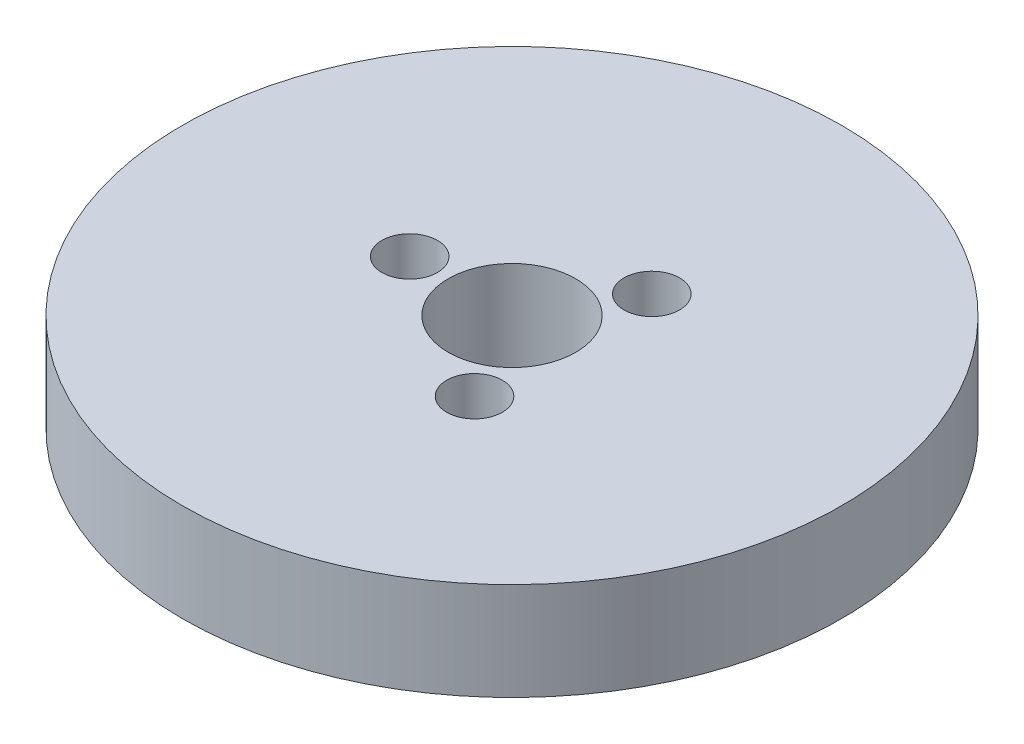
ISO-10303-21;
HEADER;
FILE_DESCRIPTION(('STEP AP214'),'2;1');
FILE_NAME('part.step','',(''),(''),'','','');
FILE_SCHEMA(('AUTOMOTIVE_DESIGN { 1 0 10303 214 1 1 1 1 }'));
ENDSEC;
DATA;
#1=APPLICATION_CONTEXT('core data for automotive mechanical design processes');
#2=APPLICATION_PROTOCOL_DEFINITION('international standard','automotive_design',2000,#1);
#3=PRODUCT_CONTEXT('',#1,'mechanical');
#4=PRODUCT('Part','Part','',(#3));
#5=PRODUCT_RELATED_PRODUCT_CATEGORY('part','',(#4));
#6=PRODUCT_DEFINITION_FORMATION('','',#4);
#7=PRODUCT_DEFINITION_CONTEXT('part definition',#1,'design');
#8=PRODUCT_DEFINITION('design','',#6,#7);
#9=PRODUCT_DEFINITION_SHAPE('','',#8);
#10=(LENGTH_UNIT() NAMED_UNIT(*) SI_UNIT(.MILLI.,.METRE.));
#11=(NAMED_UNIT(*) PLANE_ANGLE_UNIT() SI_UNIT($,.RADIAN.));
#12=(NAMED_UNIT(*) SI_UNIT($,.STERADIAN.) SOLID_ANGLE_UNIT());
#13=UNCERTAINTY_MEASURE_WITH_UNIT(LENGTH_MEASURE(1.E-05),#10,'distance_accuracy_value','');
#14=(GEOMETRIC_REPRESENTATION_CONTEXT(3) GLOBAL_UNCERTAINTY_ASSIGNED_CONTEXT((#13)) GLOBAL_UNIT_ASSIGNED_CONTEXT((#10,
#11,#12)) REPRESENTATION_CONTEXT('',''));
#15=CARTESIAN_POINT('',(0.,0.,0.));
#16=DIRECTION('',(0.,0.,1.));
#17=DIRECTION('',(1.,0.,0.));
#18=AXIS2_PLACEMENT_3D('',#15,#16,#17);
#19=CARTESIAN_POINT('',(0.,23.,0.));
#20=DIRECTION('',(0.,-1.,0.));
#21=DIRECTION('',(0.,0.,-1.));
#22=AXIS2_PLACEMENT_3D('',#19,#20,#21);
#23=CYLINDRICAL_SURFACE('',#22,77.5);
#24=CARTESIAN_POINT('',(0.,23.,0.));
#25=DIRECTION('',(0.,1.,0.));
#26=DIRECTION('',(0.,0.,1.));
#27=AXIS2_PLACEMENT_3D('',#24,#25,#26);
#28=CIRCLE('',#27,77.5);
#29=CARTESIAN_POINT('',(0.,23.,77.5));
#30=VERTEX_POINT('',#29);
#31=EDGE_CURVE('E10',#30,#30,#28,.T.);
#32=ORIENTED_EDGE('',*,*,#31,.F.);
#33=EDGE_LOOP('',(#32));
#34=FACE_BOUND('',#33,.T.);
#35=CARTESIAN_POINT('',(0.,0.,0.));
#36=DIRECTION('',(0.,1.,0.));
#37=DIRECTION('',(0.,0.,1.));
#38=AXIS2_PLACEMENT_3D('',#35,#36,#37);
#39=CIRCLE('',#38,77.5);
#40=CARTESIAN_POINT('',(0.,0.,77.5));
#41=VERTEX_POINT('',#40);
#42=EDGE_CURVE('E37',#41,#41,#39,.T.);
#43=ORIENTED_EDGE('',*,*,#42,.T.);
#44=EDGE_LOOP('',(#43));
#45=FACE_BOUND('',#44,.T.);
#46=ADVANCED_FACE('F40',(#34,#45),#23,.T.);
#47=CARTESIAN_POINT('',(0.,23.,0.));
#48=DIRECTION('',(0.,1.,0.));
#49=DIRECTION('',(0.,0.,1.));
#50=AXIS2_PLACEMENT_3D('',#47,#48,#49);
#51=PLANE('',#50);
#52=CARTESIAN_POINT('',(12.0326553938992,23.,20.841170492201));
#53=DIRECTION('',(0.,1.,0.));
#54=DIRECTION('',(0.866025403784436,0.,-0.500000000000004));
#55=AXIS2_PLACEMENT_3D('',#52,#53,#54);
#56=CIRCLE('',#55,6.54203182850288);
#57=CARTESIAN_POINT('',(17.6982211497491,23.,17.5701545779495));
#58=VERTEX_POINT('',#57);
#59=EDGE_CURVE('E70',#58,#58,#56,.T.);
#60=ORIENTED_EDGE('',*,*,#59,.F.);
#61=EDGE_LOOP('',(#60));
#62=FACE_BOUND('',#61,.T.);
#63=CARTESIAN_POINT('',(12.032655393899,23.,-20.8411704922011));
#64=DIRECTION('',(0.,1.,0.));
#65=DIRECTION('',(-0.866025403784443,0.,-0.499999999999992));
#66=AXIS2_PLACEMENT_3D('',#63,#64,#65);
#67=CIRCLE('',#66,6.54203182850288);
#68=CARTESIAN_POINT('',(6.36708963804907,23.,-24.1121864064525));
#69=VERTEX_POINT('',#68);
#70=EDGE_CURVE('E61',#69,#69,#67,.T.);
#71=ORIENTED_EDGE('',*,*,#70,.F.);
#72=EDGE_LOOP('',(#71));
#73=FACE_BOUND('',#72,.T.);
#74=CARTESIAN_POINT('',(-24.0653107877983,23.,0.));
#75=DIRECTION('',(0.,1.,0.));
#76=DIRECTION('',(0.,0.,1.));
#77=AXIS2_PLACEMENT_3D('',#74,#75,#76);
#78=CIRCLE('',#77,6.54203182850288);
#79=CARTESIAN_POINT('',(-24.0653107877983,23.,6.54203182850288));
#80=VERTEX_POINT('',#79);
#81=EDGE_CURVE('E54',#80,#80,#78,.T.);
#82=ORIENTED_EDGE('',*,*,#81,.F.);
#83=EDGE_LOOP('',(#82));
#84=FACE_BOUND('',#83,.T.);
#85=CARTESIAN_POINT('',(0.,23.,0.));
#86=DIRECTION('',(0.,1.,0.));
#87=DIRECTION('',(0.,0.,1.));
#88=AXIS2_PLACEMENT_3D('',#85,#86,#87);
#89=CIRCLE('',#88,15.);
#90=CARTESIAN_POINT('',(0.,23.,15.));
#91=VERTEX_POINT('',#90);
#92=EDGE_CURVE('E50',#91,#91,#89,.T.);
#93=ORIENTED_EDGE('',*,*,#92,.F.);
#94=EDGE_LOOP('',(#93));
#95=FACE_BOUND('',#94,.T.);
#96=ORIENTED_EDGE('',*,*,#31,.T.);
#97=EDGE_LOOP('',(#96));
#98=FACE_BOUND('',#97,.T.);
#99=ADVANCED_FACE('F85',(#62,#73,#84,#95,#98),#51,.T.);
#100=CARTESIAN_POINT('',(0.,0.,0.));
#101=DIRECTION('',(0.,1.,0.));
#102=DIRECTION('',(0.,0.,1.));
#103=AXIS2_PLACEMENT_3D('',#100,#101,#102);
#104=PLANE('',#103);
#105=CARTESIAN_POINT('',(0.,0.,0.));
#106=DIRECTION('',(0.,1.,0.));
#107=DIRECTION('',(0.,0.,1.));
#108=AXIS2_PLACEMENT_3D('',#105,#106,#107);
#109=CIRCLE('',#108,15.);
#110=CARTESIAN_POINT('',(0.,0.,15.));
#111=VERTEX_POINT('',#110);
#112=EDGE_CURVE('E47',#111,#111,#109,.T.);
#113=ORIENTED_EDGE('',*,*,#112,.T.);
#114=EDGE_LOOP('',(#113));
#115=FACE_BOUND('',#114,.T.);
#116=ORIENTED_EDGE('',*,*,#42,.F.);
#117=EDGE_LOOP('',(#116));
#118=FACE_BOUND('',#117,.T.);
#119=ADVANCED_FACE('F84',(#115,#118),#104,.F.);
#120=CARTESIAN_POINT('',(0.,23.,0.));
#121=DIRECTION('',(0.,-1.,0.));
#122=DIRECTION('',(0.,0.,-1.));
#123=AXIS2_PLACEMENT_3D('',#120,#121,#122);
#124=CYLINDRICAL_SURFACE('',#123,15.);
#125=ORIENTED_EDGE('',*,*,#92,.T.);
#126=EDGE_LOOP('',(#125));
#127=FACE_BOUND('',#126,.T.);
#128=ORIENTED_EDGE('',*,*,#112,.F.);
#129=EDGE_LOOP('',(#128));
#130=FACE_BOUND('',#129,.T.);
#131=ADVANCED_FACE('F91',(#127,#130),#124,.F.);
#132=CARTESIAN_POINT('',(-24.0653107877983,2.82347425636033,0.));
#133=DIRECTION('',(0.,1.,0.));
#134=DIRECTION('',(0.,0.,1.));
#135=AXIS2_PLACEMENT_3D('',#132,#133,#134);
#136=CYLINDRICAL_SURFACE('',#135,6.54203182850288);
#137=CARTESIAN_POINT('',(-24.0653107877983,2.82347425636033,0.));
#138=DIRECTION('',(0.,1.,0.));
#139=DIRECTION('',(0.,0.,1.));
#140=AXIS2_PLACEMENT_3D('',#137,#138,#139);
#141=CIRCLE('',#140,6.54203182850288);
#142=CARTESIAN_POINT('',(-24.0653107877983,2.82347425636033,6.54203182850288));
#143=VERTEX_POINT('',#142);
#144=EDGE_CURVE('E55',#143,#143,#141,.T.);
#145=ORIENTED_EDGE('',*,*,#144,.F.);
#146=EDGE_LOOP('',(#145));
#147=FACE_BOUND('',#146,.T.);
#148=ORIENTED_EDGE('',*,*,#81,.T.);
#149=EDGE_LOOP('',(#148));
#150=FACE_BOUND('',#149,.T.);
#151=ADVANCED_FACE('F96',(#147,#150),#136,.F.);
#152=CARTESIAN_POINT('',(-24.0653107877983,2.82347425636033,0.));
#153=DIRECTION('',(0.,1.,0.));
#154=DIRECTION('',(0.,0.,1.));
#155=AXIS2_PLACEMENT_3D('',#152,#153,#154);
#156=PLANE('',#155);
#157=ORIENTED_EDGE('',*,*,#144,.T.);
#158=EDGE_LOOP('',(#157));
#159=FACE_BOUND('',#158,.T.);
#160=ADVANCED_FACE('F127',(#159),#156,.T.);
#161=CARTESIAN_POINT('',(12.032655393899,2.82347425636033,-20.8411704922011));
#162=DIRECTION('',(0.,1.,0.));
#163=DIRECTION('',(0.,0.,1.));
#164=AXIS2_PLACEMENT_3D('',#161,#162,#163);
#165=CYLINDRICAL_SURFACE('',#164,6.54203182850288);
#166=CARTESIAN_POINT('',(12.032655393899,2.82347425636033,-20.8411704922011));
#167=DIRECTION('',(0.,1.,0.));
#168=DIRECTION('',(-0.866025403784443,0.,-0.499999999999992));
#169=AXIS2_PLACEMENT_3D('',#166,#167,#168);
#170=CIRCLE('',#169,6.54203182850288);
#171=CARTESIAN_POINT('',(6.36708963804907,2.82347425636033,-24.1121864064525));
#172=VERTEX_POINT('',#171);
#173=EDGE_CURVE('E63',#172,#172,#170,.T.);
#174=ORIENTED_EDGE('',*,*,#173,.F.);
#175=EDGE_LOOP('',(#174));
#176=FACE_BOUND('',#175,.T.);
#177=ORIENTED_EDGE('',*,*,#70,.T.);
#178=EDGE_LOOP('',(#177));
#179=FACE_BOUND('',#178,.T.);
#180=ADVANCED_FACE('F133',(#176,#179),#165,.F.);
#181=CARTESIAN_POINT('',(12.032655393899,2.82347425636033,-20.8411704922011));
#182=DIRECTION('',(0.,1.,0.));
#183=DIRECTION('',(-0.866025403784443,0.,-0.499999999999992));
#184=AXIS2_PLACEMENT_3D('',#181,#182,#183);
#185=PLANE('',#184);
#186=ORIENTED_EDGE('',*,*,#173,.T.);
#187=EDGE_LOOP('',(#186));
#188=FACE_BOUND('',#187,.T.);
#189=ADVANCED_FACE('F77',(#188),#185,.T.);
#190=CARTESIAN_POINT('',(12.0326553938992,2.82347425636033,20.841170492201));
#191=DIRECTION('',(0.,1.,0.));
#192=DIRECTION('',(0.,0.,1.));
#193=AXIS2_PLACEMENT_3D('',#190,#191,#192);
#194=CYLINDRICAL_SURFACE('',#193,6.54203182850288);
#195=CARTESIAN_POINT('',(12.0326553938992,2.82347425636033,20.841170492201));
#196=DIRECTION('',(0.,1.,0.));
#197=DIRECTION('',(0.866025403784436,0.,-0.500000000000004));
#198=AXIS2_PLACEMENT_3D('',#195,#196,#197);
#199=CIRCLE('',#198,6.54203182850288);
#200=CARTESIAN_POINT('',(17.6982211497491,2.82347425636033,17.5701545779495));
#201=VERTEX_POINT('',#200);
#202=EDGE_CURVE('E59',#201,#201,#199,.T.);
#203=ORIENTED_EDGE('',*,*,#202,.F.);
#204=EDGE_LOOP('',(#203));
#205=FACE_BOUND('',#204,.T.);
#206=ORIENTED_EDGE('',*,*,#59,.T.);
#207=EDGE_LOOP('',(#206));
#208=FACE_BOUND('',#207,.T.);
#209=ADVANCED_FACE('F73',(#205,#208),#194,.F.);
#210=CARTESIAN_POINT('',(12.0326553938992,2.82347425636033,20.841170492201));
#211=DIRECTION('',(0.,1.,0.));
#212=DIRECTION('',(0.866025403784436,0.,-0.500000000000004));
#213=AXIS2_PLACEMENT_3D('',#210,#211,#212);
#214=PLANE('',#213);
#215=ORIENTED_EDGE('',*,*,#202,.T.);
#216=EDGE_LOOP('',(#215));
#217=FACE_BOUND('',#216,.T.);
#218=ADVANCED_FACE('F71',(#217),#214,.T.);
#219=CLOSED_SHELL('',(#46,#99,#119,#131,#151,#160,#180,#189,#209,#218));
#220=MANIFOLD_SOLID_BREP('B2',#219);
#221=ADVANCED_BREP_SHAPE_REPRESENTATION('',(#18,#220),#14);
#222=SHAPE_DEFINITION_REPRESENTATION(#9,#221);
ENDSEC;
END-ISO-10303-21;
